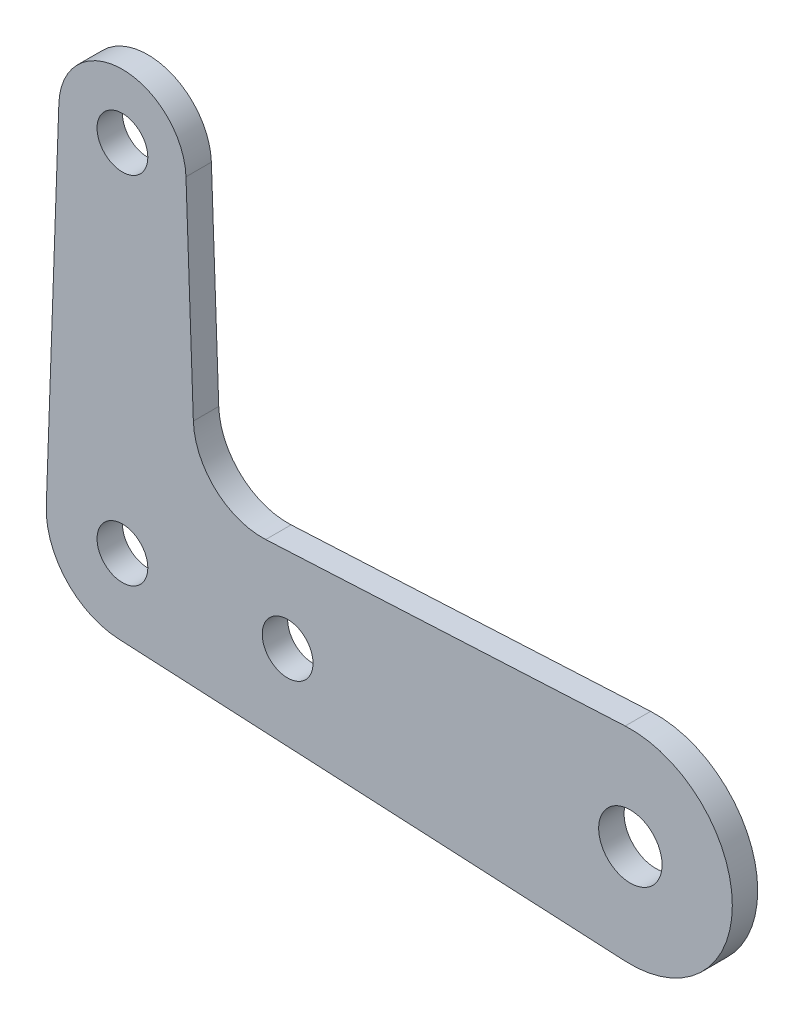
ISO-10303-21;
HEADER;
FILE_DESCRIPTION(('STEP AP214'),'2;1');
FILE_NAME('part.step','',(''),(''),'','','');
FILE_SCHEMA(('AUTOMOTIVE_DESIGN { 1 0 10303 214 1 1 1 1 }'));
ENDSEC;
DATA;
#1=APPLICATION_CONTEXT('core data for automotive mechanical design processes');
#2=APPLICATION_PROTOCOL_DEFINITION('international standard','automotive_design',2000,#1);
#3=PRODUCT_CONTEXT('',#1,'mechanical');
#4=PRODUCT('Part','Part','',(#3));
#5=PRODUCT_RELATED_PRODUCT_CATEGORY('part','',(#4));
#6=PRODUCT_DEFINITION_FORMATION('','',#4);
#7=PRODUCT_DEFINITION_CONTEXT('part definition',#1,'design');
#8=PRODUCT_DEFINITION('design','',#6,#7);
#9=PRODUCT_DEFINITION_SHAPE('','',#8);
#10=(LENGTH_UNIT() NAMED_UNIT(*) SI_UNIT(.MILLI.,.METRE.));
#11=(NAMED_UNIT(*) PLANE_ANGLE_UNIT() SI_UNIT($,.RADIAN.));
#12=(NAMED_UNIT(*) SI_UNIT($,.STERADIAN.) SOLID_ANGLE_UNIT());
#13=UNCERTAINTY_MEASURE_WITH_UNIT(LENGTH_MEASURE(1.E-05),#10,'distance_accuracy_value','');
#14=(GEOMETRIC_REPRESENTATION_CONTEXT(3) GLOBAL_UNCERTAINTY_ASSIGNED_CONTEXT((#13)) GLOBAL_UNIT_ASSIGNED_CONTEXT((#10,
#11,#12)) REPRESENTATION_CONTEXT('',''));
#15=CARTESIAN_POINT('',(0.,0.,0.));
#16=DIRECTION('',(0.,0.,1.));
#17=DIRECTION('',(1.,0.,0.));
#18=AXIS2_PLACEMENT_3D('',#15,#16,#17);
#19=CARTESIAN_POINT('',(0.,17.5,1.25));
#20=DIRECTION('',(0.,0.,-1.));
#21=DIRECTION('',(-1.,0.,0.));
#22=AXIS2_PLACEMENT_3D('',#19,#20,#21);
#23=PLANE('',#22);
#24=CARTESIAN_POINT('',(0.,17.5,1.25));
#25=DIRECTION('',(0.,0.,1.));
#26=DIRECTION('',(-1.,0.,0.));
#27=AXIS2_PLACEMENT_3D('',#24,#25,#26);
#28=CIRCLE('',#27,3.13);
#29=CARTESIAN_POINT('',(3.12803502075495,17.6108914285714,1.25));
#30=VERTEX_POINT('',#29);
#31=CARTESIAN_POINT('',(-3.12803502075495,17.6108914285714,1.25));
#32=VERTEX_POINT('',#31);
#33=EDGE_CURVE('E145',#30,#32,#28,.T.);
#34=ORIENTED_EDGE('',*,*,#33,.T.);
#35=DIRECTION('',(-0.0354285714285714,-0.999372211103816,0.));
#36=VECTOR('',#35,1.);
#37=CARTESIAN_POINT('',(-3.74764579163931,0.132857142857143,1.25));
#38=LINE('',#37,#36);
#39=CARTESIAN_POINT('',(-3.74764579163931,0.132857142857143,1.25));
#40=VERTEX_POINT('',#39);
#41=EDGE_CURVE('E93',#32,#40,#38,.T.);
#42=ORIENTED_EDGE('',*,*,#41,.T.);
#43=CARTESIAN_POINT('',(0.,0.,1.25));
#44=DIRECTION('',(0.,0.,1.));
#45=DIRECTION('',(-1.,0.,0.));
#46=AXIS2_PLACEMENT_3D('',#43,#44,#45);
#47=CIRCLE('',#46,3.75);
#48=CARTESIAN_POINT('',(-0.190199042298668,-3.74517347052292,1.25));
#49=VERTEX_POINT('',#48);
#50=EDGE_CURVE('E160',#40,#49,#47,.T.);
#51=ORIENTED_EDGE('',*,*,#50,.T.);
#52=DIRECTION('',(0.998712925472778,-0.0507197446129784,0.));
#53=VECTOR('',#52,1.);
#54=CARTESIAN_POINT('',(-0.190199042298669,-3.74517347052292,1.25));
#55=LINE('',#54,#53);
#56=CARTESIAN_POINT('',(24.7454886453612,-5.01153508356441,1.25));
#57=VERTEX_POINT('',#56);
#58=EDGE_CURVE('E173',#49,#57,#55,.T.);
#59=ORIENTED_EDGE('',*,*,#58,.T.);
#60=CARTESIAN_POINT('',(25.,0.,1.25));
#61=DIRECTION('',(0.,0.,1.));
#62=DIRECTION('',(-1.,0.,0.));
#63=AXIS2_PLACEMENT_3D('',#60,#61,#62);
#64=CIRCLE('',#63,5.01799361532446);
#65=CARTESIAN_POINT('',(24.7454886453612,5.01153508356441,1.25));
#66=VERTEX_POINT('',#65);
#67=EDGE_CURVE('E112',#57,#66,#64,.T.);
#68=ORIENTED_EDGE('',*,*,#67,.T.);
#69=DIRECTION('',(-0.998712925472778,-0.0507197446129784,0.));
#70=VECTOR('',#69,1.);
#71=CARTESIAN_POINT('',(7.05201069325777,4.11296988013398,1.25));
#72=LINE('',#71,#70);
#73=CARTESIAN_POINT('',(7.05201069325777,4.11296988013398,1.25));
#74=VERTEX_POINT('',#73);
#75=EDGE_CURVE('E106',#66,#74,#72,.T.);
#76=ORIENTED_EDGE('',*,*,#75,.T.);
#77=CARTESIAN_POINT('',(6.88,7.5,1.25));
#78=DIRECTION('',(0.,0.,-1.));
#79=DIRECTION('',(-1.,0.,0.));
#80=AXIS2_PLACEMENT_3D('',#77,#78,#79);
#81=CIRCLE('',#80,3.39139509810854);
#82=CARTESIAN_POINT('',(3.49073398207662,7.37984771652415,1.25));
#83=VERTEX_POINT('',#82);
#84=EDGE_CURVE('E110',#74,#83,#81,.T.);
#85=ORIENTED_EDGE('',*,*,#84,.T.);
#86=DIRECTION('',(-0.0354285714285715,0.999372211103816,0.));
#87=VECTOR('',#86,1.);
#88=CARTESIAN_POINT('',(3.49073398207663,7.37984771652415,1.25));
#89=LINE('',#88,#87);
#90=EDGE_CURVE('E50',#83,#30,#89,.T.);
#91=ORIENTED_EDGE('',*,*,#90,.T.);
#92=EDGE_LOOP('',(#34,#42,#51,#59,#68,#76,#85,#91));
#93=FACE_BOUND('',#92,.T.);
#94=CARTESIAN_POINT('',(0.,0.,1.25));
#95=DIRECTION('',(0.,0.,1.));
#96=DIRECTION('',(1.,0.,0.));
#97=AXIS2_PLACEMENT_3D('',#94,#95,#96);
#98=CIRCLE('',#97,1.25);
#99=CARTESIAN_POINT('',(1.25,0.,1.25));
#100=VERTEX_POINT('',#99);
#101=EDGE_CURVE('E134',#100,#100,#98,.T.);
#102=ORIENTED_EDGE('',*,*,#101,.F.);
#103=EDGE_LOOP('',(#102));
#104=FACE_BOUND('',#103,.T.);
#105=CARTESIAN_POINT('',(8.13,0.,1.25));
#106=DIRECTION('',(0.,0.,1.));
#107=DIRECTION('',(1.,0.,0.));
#108=AXIS2_PLACEMENT_3D('',#105,#106,#107);
#109=CIRCLE('',#108,1.25);
#110=CARTESIAN_POINT('',(9.38,0.,1.25));
#111=VERTEX_POINT('',#110);
#112=EDGE_CURVE('E182',#111,#111,#109,.T.);
#113=ORIENTED_EDGE('',*,*,#112,.F.);
#114=EDGE_LOOP('',(#113));
#115=FACE_BOUND('',#114,.T.);
#116=CARTESIAN_POINT('',(0.,17.5,1.25));
#117=DIRECTION('',(0.,0.,1.));
#118=DIRECTION('',(1.,0.,0.));
#119=AXIS2_PLACEMENT_3D('',#116,#117,#118);
#120=CIRCLE('',#119,1.25);
#121=CARTESIAN_POINT('',(1.25,17.5,1.25));
#122=VERTEX_POINT('',#121);
#123=EDGE_CURVE('E188',#122,#122,#120,.T.);
#124=ORIENTED_EDGE('',*,*,#123,.F.);
#125=EDGE_LOOP('',(#124));
#126=FACE_BOUND('',#125,.T.);
#127=CARTESIAN_POINT('',(25.,0.,1.25));
#128=DIRECTION('',(0.,0.,1.));
#129=DIRECTION('',(1.,0.,0.));
#130=AXIS2_PLACEMENT_3D('',#127,#128,#129);
#131=CIRCLE('',#130,1.56);
#132=CARTESIAN_POINT('',(26.56,0.,1.25));
#133=VERTEX_POINT('',#132);
#134=EDGE_CURVE('E194',#133,#133,#131,.T.);
#135=ORIENTED_EDGE('',*,*,#134,.F.);
#136=EDGE_LOOP('',(#135));
#137=FACE_BOUND('',#136,.T.);
#138=ADVANCED_FACE('F33',(#93,#104,#115,#126,#137),#23,.F.);
#139=CARTESIAN_POINT('',(0.,17.5,0.));
#140=DIRECTION('',(0.,0.,-1.));
#141=DIRECTION('',(-1.,0.,0.));
#142=AXIS2_PLACEMENT_3D('',#139,#140,#141);
#143=PLANE('',#142);
#144=CARTESIAN_POINT('',(0.,17.5,0.));
#145=DIRECTION('',(0.,0.,1.));
#146=DIRECTION('',(1.,0.,0.));
#147=AXIS2_PLACEMENT_3D('',#144,#145,#146);
#148=CIRCLE('',#147,1.25);
#149=CARTESIAN_POINT('',(1.25,17.5,0.));
#150=VERTEX_POINT('',#149);
#151=EDGE_CURVE('E191',#150,#150,#148,.T.);
#152=ORIENTED_EDGE('',*,*,#151,.T.);
#153=EDGE_LOOP('',(#152));
#154=FACE_BOUND('',#153,.T.);
#155=CARTESIAN_POINT('',(0.,0.,0.));
#156=DIRECTION('',(0.,0.,1.));
#157=DIRECTION('',(1.,0.,0.));
#158=AXIS2_PLACEMENT_3D('',#155,#156,#157);
#159=CIRCLE('',#158,1.25);
#160=CARTESIAN_POINT('',(1.25,0.,0.));
#161=VERTEX_POINT('',#160);
#162=EDGE_CURVE('E179',#161,#161,#159,.T.);
#163=ORIENTED_EDGE('',*,*,#162,.T.);
#164=EDGE_LOOP('',(#163));
#165=FACE_BOUND('',#164,.T.);
#166=CARTESIAN_POINT('',(0.,17.5,0.));
#167=DIRECTION('',(0.,0.,1.));
#168=DIRECTION('',(-1.,0.,0.));
#169=AXIS2_PLACEMENT_3D('',#166,#167,#168);
#170=CIRCLE('',#169,3.13);
#171=CARTESIAN_POINT('',(3.12803502075495,17.6108914285714,0.));
#172=VERTEX_POINT('',#171);
#173=CARTESIAN_POINT('',(-3.12803502075495,17.6108914285714,0.));
#174=VERTEX_POINT('',#173);
#175=EDGE_CURVE('E130',#172,#174,#170,.T.);
#176=ORIENTED_EDGE('',*,*,#175,.F.);
#177=DIRECTION('',(-0.0354285714285715,0.999372211103816,0.));
#178=VECTOR('',#177,1.);
#179=CARTESIAN_POINT('',(3.49073398207663,7.37984771652415,0.));
#180=LINE('',#179,#178);
#181=CARTESIAN_POINT('',(3.49073398207662,7.37984771652415,0.));
#182=VERTEX_POINT('',#181);
#183=EDGE_CURVE('E85',#182,#172,#180,.T.);
#184=ORIENTED_EDGE('',*,*,#183,.F.);
#185=CARTESIAN_POINT('',(6.88,7.5,0.));
#186=DIRECTION('',(0.,0.,-1.));
#187=DIRECTION('',(-1.,0.,0.));
#188=AXIS2_PLACEMENT_3D('',#185,#186,#187);
#189=CIRCLE('',#188,3.39139509810854);
#190=CARTESIAN_POINT('',(7.05201069325777,4.11296988013398,0.));
#191=VERTEX_POINT('',#190);
#192=EDGE_CURVE('E79',#191,#182,#189,.T.);
#193=ORIENTED_EDGE('',*,*,#192,.F.);
#194=DIRECTION('',(-0.998712925472778,-0.0507197446129784,0.));
#195=VECTOR('',#194,1.);
#196=CARTESIAN_POINT('',(7.05201069325777,4.11296988013398,0.));
#197=LINE('',#196,#195);
#198=CARTESIAN_POINT('',(24.7454886453612,5.01153508356441,0.));
#199=VERTEX_POINT('',#198);
#200=EDGE_CURVE('E120',#199,#191,#197,.T.);
#201=ORIENTED_EDGE('',*,*,#200,.F.);
#202=CARTESIAN_POINT('',(25.,0.,0.));
#203=DIRECTION('',(0.,0.,1.));
#204=DIRECTION('',(-1.,0.,0.));
#205=AXIS2_PLACEMENT_3D('',#202,#203,#204);
#206=CIRCLE('',#205,5.01799361532446);
#207=CARTESIAN_POINT('',(24.7454886453612,-5.01153508356441,0.));
#208=VERTEX_POINT('',#207);
#209=EDGE_CURVE('E140',#208,#199,#206,.T.);
#210=ORIENTED_EDGE('',*,*,#209,.F.);
#211=DIRECTION('',(0.998712925472778,-0.0507197446129784,0.));
#212=VECTOR('',#211,1.);
#213=CARTESIAN_POINT('',(-0.190199042298669,-3.74517347052292,0.));
#214=LINE('',#213,#212);
#215=CARTESIAN_POINT('',(-0.190199042298668,-3.74517347052292,0.));
#216=VERTEX_POINT('',#215);
#217=EDGE_CURVE('E138',#216,#208,#214,.T.);
#218=ORIENTED_EDGE('',*,*,#217,.F.);
#219=CARTESIAN_POINT('',(0.,0.,0.));
#220=DIRECTION('',(0.,0.,1.));
#221=DIRECTION('',(-1.,0.,0.));
#222=AXIS2_PLACEMENT_3D('',#219,#220,#221);
#223=CIRCLE('',#222,3.75);
#224=CARTESIAN_POINT('',(-3.74764579163931,0.132857142857143,0.));
#225=VERTEX_POINT('',#224);
#226=EDGE_CURVE('E136',#225,#216,#223,.T.);
#227=ORIENTED_EDGE('',*,*,#226,.F.);
#228=DIRECTION('',(-0.0354285714285714,-0.999372211103816,0.));
#229=VECTOR('',#228,1.);
#230=CARTESIAN_POINT('',(-3.74764579163931,0.132857142857143,0.));
#231=LINE('',#230,#229);
#232=EDGE_CURVE('E133',#174,#225,#231,.T.);
#233=ORIENTED_EDGE('',*,*,#232,.F.);
#234=EDGE_LOOP('',(#176,#184,#193,#201,#210,#218,#227,#233));
#235=FACE_BOUND('',#234,.T.);
#236=CARTESIAN_POINT('',(8.13,0.,0.));
#237=DIRECTION('',(0.,0.,1.));
#238=DIRECTION('',(1.,0.,0.));
#239=AXIS2_PLACEMENT_3D('',#236,#237,#238);
#240=CIRCLE('',#239,1.25);
#241=CARTESIAN_POINT('',(9.38,0.,0.));
#242=VERTEX_POINT('',#241);
#243=EDGE_CURVE('E185',#242,#242,#240,.T.);
#244=ORIENTED_EDGE('',*,*,#243,.T.);
#245=EDGE_LOOP('',(#244));
#246=FACE_BOUND('',#245,.T.);
#247=CARTESIAN_POINT('',(25.,0.,0.));
#248=DIRECTION('',(0.,0.,1.));
#249=DIRECTION('',(1.,0.,0.));
#250=AXIS2_PLACEMENT_3D('',#247,#248,#249);
#251=CIRCLE('',#250,1.56);
#252=CARTESIAN_POINT('',(26.56,0.,0.));
#253=VERTEX_POINT('',#252);
#254=EDGE_CURVE('E197',#253,#253,#251,.T.);
#255=ORIENTED_EDGE('',*,*,#254,.T.);
#256=EDGE_LOOP('',(#255));
#257=FACE_BOUND('',#256,.T.);
#258=ADVANCED_FACE('F164',(#154,#165,#235,#246,#257),#143,.T.);
#259=CARTESIAN_POINT('',(0.,17.5,1.25));
#260=DIRECTION('',(0.,0.,-1.));
#261=DIRECTION('',(-1.,0.,0.));
#262=AXIS2_PLACEMENT_3D('',#259,#260,#261);
#263=CYLINDRICAL_SURFACE('',#262,3.13);
#264=ORIENTED_EDGE('',*,*,#175,.T.);
#265=DIRECTION('',(0.,0.,-1.));
#266=VECTOR('',#265,1.);
#267=CARTESIAN_POINT('',(-3.12803502075495,17.6108914285714,1.25));
#268=LINE('',#267,#266);
#269=EDGE_CURVE('E11',#32,#174,#268,.T.);
#270=ORIENTED_EDGE('',*,*,#269,.F.);
#271=ORIENTED_EDGE('',*,*,#33,.F.);
#272=DIRECTION('',(0.,0.,-1.));
#273=VECTOR('',#272,1.);
#274=CARTESIAN_POINT('',(3.12803502075495,17.6108914285714,1.25));
#275=LINE('',#274,#273);
#276=EDGE_CURVE('E126',#30,#172,#275,.T.);
#277=ORIENTED_EDGE('',*,*,#276,.T.);
#278=EDGE_LOOP('',(#264,#270,#271,#277));
#279=FACE_BOUND('',#278,.T.);
#280=ADVANCED_FACE('F35',(#279),#263,.T.);
#281=CARTESIAN_POINT('',(-3.74764579163931,0.132857142857143,1.25));
#282=DIRECTION('',(0.999372211103816,-0.0354285714285714,0.));
#283=DIRECTION('',(0.0354285714285714,0.999372211103816,0.));
#284=AXIS2_PLACEMENT_3D('',#281,#282,#283);
#285=PLANE('',#284);
#286=ORIENTED_EDGE('',*,*,#232,.T.);
#287=DIRECTION('',(0.,0.,-1.));
#288=VECTOR('',#287,1.);
#289=CARTESIAN_POINT('',(-3.74764579163931,0.132857142857143,1.25));
#290=LINE('',#289,#288);
#291=EDGE_CURVE('E42',#40,#225,#290,.T.);
#292=ORIENTED_EDGE('',*,*,#291,.F.);
#293=ORIENTED_EDGE('',*,*,#41,.F.);
#294=ORIENTED_EDGE('',*,*,#269,.T.);
#295=EDGE_LOOP('',(#286,#292,#293,#294));
#296=FACE_BOUND('',#295,.T.);
#297=ADVANCED_FACE('F229',(#296),#285,.F.);
#298=CARTESIAN_POINT('',(0.,0.,1.25));
#299=DIRECTION('',(0.,0.,-1.));
#300=DIRECTION('',(-1.,0.,0.));
#301=AXIS2_PLACEMENT_3D('',#298,#299,#300);
#302=CYLINDRICAL_SURFACE('',#301,3.75);
#303=ORIENTED_EDGE('',*,*,#226,.T.);
#304=DIRECTION('',(0.,0.,-1.));
#305=VECTOR('',#304,1.);
#306=CARTESIAN_POINT('',(-0.190199042298668,-3.74517347052292,1.25));
#307=LINE('',#306,#305);
#308=EDGE_CURVE('E152',#49,#216,#307,.T.);
#309=ORIENTED_EDGE('',*,*,#308,.F.);
#310=ORIENTED_EDGE('',*,*,#50,.F.);
#311=ORIENTED_EDGE('',*,*,#291,.T.);
#312=EDGE_LOOP('',(#303,#309,#310,#311));
#313=FACE_BOUND('',#312,.T.);
#314=ADVANCED_FACE('F158',(#313),#302,.T.);
#315=CARTESIAN_POINT('',(-0.190199042298669,-3.74517347052292,1.25));
#316=DIRECTION('',(0.0507197446129784,0.998712925472778,0.));
#317=DIRECTION('',(-0.998712925472778,0.0507197446129784,0.));
#318=AXIS2_PLACEMENT_3D('',#315,#316,#317);
#319=PLANE('',#318);
#320=ORIENTED_EDGE('',*,*,#217,.T.);
#321=DIRECTION('',(0.,0.,-1.));
#322=VECTOR('',#321,1.);
#323=CARTESIAN_POINT('',(24.7454886453612,-5.01153508356441,1.25));
#324=LINE('',#323,#322);
#325=EDGE_CURVE('E149',#57,#208,#324,.T.);
#326=ORIENTED_EDGE('',*,*,#325,.F.);
#327=ORIENTED_EDGE('',*,*,#58,.F.);
#328=ORIENTED_EDGE('',*,*,#308,.T.);
#329=EDGE_LOOP('',(#320,#326,#327,#328));
#330=FACE_BOUND('',#329,.T.);
#331=ADVANCED_FACE('F169',(#330),#319,.F.);
#332=CARTESIAN_POINT('',(25.,0.,1.25));
#333=DIRECTION('',(0.,0.,-1.));
#334=DIRECTION('',(-1.,0.,0.));
#335=AXIS2_PLACEMENT_3D('',#332,#333,#334);
#336=CYLINDRICAL_SURFACE('',#335,5.01799361532446);
#337=ORIENTED_EDGE('',*,*,#209,.T.);
#338=DIRECTION('',(0.,0.,-1.));
#339=VECTOR('',#338,1.);
#340=CARTESIAN_POINT('',(24.7454886453612,5.01153508356441,1.25));
#341=LINE('',#340,#339);
#342=EDGE_CURVE('E121',#66,#199,#341,.T.);
#343=ORIENTED_EDGE('',*,*,#342,.F.);
#344=ORIENTED_EDGE('',*,*,#67,.F.);
#345=ORIENTED_EDGE('',*,*,#325,.T.);
#346=EDGE_LOOP('',(#337,#343,#344,#345));
#347=FACE_BOUND('',#346,.T.);
#348=ADVANCED_FACE('F172',(#347),#336,.T.);
#349=CARTESIAN_POINT('',(7.05201069325777,4.11296988013398,1.25));
#350=DIRECTION('',(0.0507197446129784,-0.998712925472778,0.));
#351=DIRECTION('',(0.998712925472778,0.0507197446129784,0.));
#352=AXIS2_PLACEMENT_3D('',#349,#350,#351);
#353=PLANE('',#352);
#354=ORIENTED_EDGE('',*,*,#200,.T.);
#355=DIRECTION('',(0.,0.,-1.));
#356=VECTOR('',#355,1.);
#357=CARTESIAN_POINT('',(7.05201069325777,4.11296988013398,1.25));
#358=LINE('',#357,#356);
#359=EDGE_CURVE('E117',#74,#191,#358,.T.);
#360=ORIENTED_EDGE('',*,*,#359,.F.);
#361=ORIENTED_EDGE('',*,*,#75,.F.);
#362=ORIENTED_EDGE('',*,*,#342,.T.);
#363=EDGE_LOOP('',(#354,#360,#361,#362));
#364=FACE_BOUND('',#363,.T.);
#365=ADVANCED_FACE('F118',(#364),#353,.F.);
#366=CARTESIAN_POINT('',(6.88,7.5,1.25));
#367=DIRECTION('',(0.,0.,-1.));
#368=DIRECTION('',(-1.,0.,0.));
#369=AXIS2_PLACEMENT_3D('',#366,#367,#368);
#370=CYLINDRICAL_SURFACE('',#369,3.39139509810854);
#371=ORIENTED_EDGE('',*,*,#192,.T.);
#372=DIRECTION('',(0.,0.,-1.));
#373=VECTOR('',#372,1.);
#374=CARTESIAN_POINT('',(3.49073398207662,7.37984771652415,1.25));
#375=LINE('',#374,#373);
#376=EDGE_CURVE('E122',#83,#182,#375,.T.);
#377=ORIENTED_EDGE('',*,*,#376,.F.);
#378=ORIENTED_EDGE('',*,*,#84,.F.);
#379=ORIENTED_EDGE('',*,*,#359,.T.);
#380=EDGE_LOOP('',(#371,#377,#378,#379));
#381=FACE_BOUND('',#380,.T.);
#382=ADVANCED_FACE('F124',(#381),#370,.F.);
#383=CARTESIAN_POINT('',(3.49073398207663,7.37984771652415,1.25));
#384=DIRECTION('',(-0.999372211103816,-0.0354285714285715,0.));
#385=DIRECTION('',(0.0354285714285715,-0.999372211103816,0.));
#386=AXIS2_PLACEMENT_3D('',#383,#384,#385);
#387=PLANE('',#386);
#388=ORIENTED_EDGE('',*,*,#183,.T.);
#389=ORIENTED_EDGE('',*,*,#276,.F.);
#390=ORIENTED_EDGE('',*,*,#90,.F.);
#391=ORIENTED_EDGE('',*,*,#376,.T.);
#392=EDGE_LOOP('',(#388,#389,#390,#391));
#393=FACE_BOUND('',#392,.T.);
#394=ADVANCED_FACE('F217',(#393),#387,.F.);
#395=CARTESIAN_POINT('',(0.,0.,1.25));
#396=DIRECTION('',(0.,0.,-1.));
#397=DIRECTION('',(-1.,0.,0.));
#398=AXIS2_PLACEMENT_3D('',#395,#396,#397);
#399=CYLINDRICAL_SURFACE('',#398,1.25);
#400=ORIENTED_EDGE('',*,*,#101,.T.);
#401=EDGE_LOOP('',(#400));
#402=FACE_BOUND('',#401,.T.);
#403=ORIENTED_EDGE('',*,*,#162,.F.);
#404=EDGE_LOOP('',(#403));
#405=FACE_BOUND('',#404,.T.);
#406=ADVANCED_FACE('F214',(#402,#405),#399,.F.);
#407=CARTESIAN_POINT('',(8.13,0.,1.25));
#408=DIRECTION('',(0.,0.,-1.));
#409=DIRECTION('',(-1.,0.,0.));
#410=AXIS2_PLACEMENT_3D('',#407,#408,#409);
#411=CYLINDRICAL_SURFACE('',#410,1.25);
#412=ORIENTED_EDGE('',*,*,#112,.T.);
#413=EDGE_LOOP('',(#412));
#414=FACE_BOUND('',#413,.T.);
#415=ORIENTED_EDGE('',*,*,#243,.F.);
#416=EDGE_LOOP('',(#415));
#417=FACE_BOUND('',#416,.T.);
#418=ADVANCED_FACE('F293',(#414,#417),#411,.F.);
#419=CARTESIAN_POINT('',(0.,17.5,1.25));
#420=DIRECTION('',(0.,0.,-1.));
#421=DIRECTION('',(-1.,0.,0.));
#422=AXIS2_PLACEMENT_3D('',#419,#420,#421);
#423=CYLINDRICAL_SURFACE('',#422,1.25);
#424=ORIENTED_EDGE('',*,*,#123,.T.);
#425=EDGE_LOOP('',(#424));
#426=FACE_BOUND('',#425,.T.);
#427=ORIENTED_EDGE('',*,*,#151,.F.);
#428=EDGE_LOOP('',(#427));
#429=FACE_BOUND('',#428,.T.);
#430=ADVANCED_FACE('F301',(#426,#429),#423,.F.);
#431=CARTESIAN_POINT('',(25.,0.,1.25));
#432=DIRECTION('',(0.,0.,-1.));
#433=DIRECTION('',(-1.,0.,0.));
#434=AXIS2_PLACEMENT_3D('',#431,#432,#433);
#435=CYLINDRICAL_SURFACE('',#434,1.56);
#436=ORIENTED_EDGE('',*,*,#134,.T.);
#437=EDGE_LOOP('',(#436));
#438=FACE_BOUND('',#437,.T.);
#439=ORIENTED_EDGE('',*,*,#254,.F.);
#440=EDGE_LOOP('',(#439));
#441=FACE_BOUND('',#440,.T.);
#442=ADVANCED_FACE('F203',(#438,#441),#435,.F.);
#443=CLOSED_SHELL('',(#138,#258,#280,#297,#314,#331,#348,#365,#382,#394,#406,#418,#430,#442));
#444=MANIFOLD_SOLID_BREP('B2',#443);
#445=ADVANCED_BREP_SHAPE_REPRESENTATION('',(#18,#444),#14);
#446=SHAPE_DEFINITION_REPRESENTATION(#9,#445);
ENDSEC;
END-ISO-10303-21;
